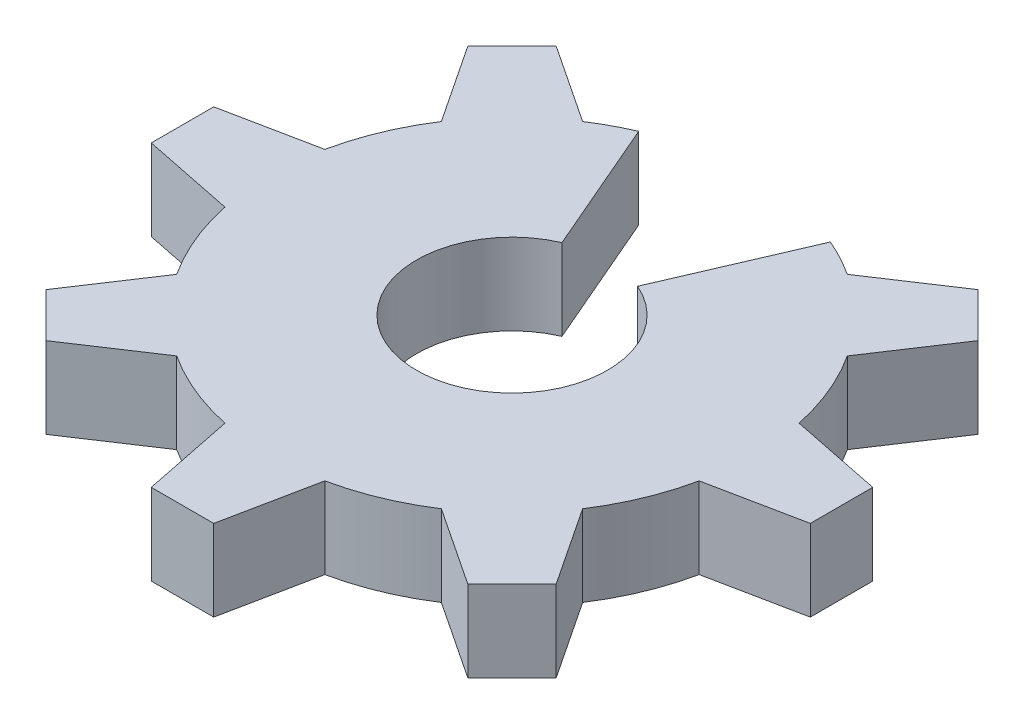
ISO-10303-21;
HEADER;
FILE_DESCRIPTION(('STEP AP214'),'2;1');
FILE_NAME('part.step','',(''),(''),'','','');
FILE_SCHEMA(('AUTOMOTIVE_DESIGN { 1 0 10303 214 1 1 1 1 }'));
ENDSEC;
DATA;
#1=APPLICATION_CONTEXT('core data for automotive mechanical design processes');
#2=APPLICATION_PROTOCOL_DEFINITION('international standard','automotive_design',2000,#1);
#3=PRODUCT_CONTEXT('',#1,'mechanical');
#4=PRODUCT('Part','Part','',(#3));
#5=PRODUCT_RELATED_PRODUCT_CATEGORY('part','',(#4));
#6=PRODUCT_DEFINITION_FORMATION('','',#4);
#7=PRODUCT_DEFINITION_CONTEXT('part definition',#1,'design');
#8=PRODUCT_DEFINITION('design','',#6,#7);
#9=PRODUCT_DEFINITION_SHAPE('','',#8);
#10=(LENGTH_UNIT() NAMED_UNIT(*) SI_UNIT(.MILLI.,.METRE.));
#11=(NAMED_UNIT(*) PLANE_ANGLE_UNIT() SI_UNIT($,.RADIAN.));
#12=(NAMED_UNIT(*) SI_UNIT($,.STERADIAN.) SOLID_ANGLE_UNIT());
#13=UNCERTAINTY_MEASURE_WITH_UNIT(LENGTH_MEASURE(1.E-05),#10,'distance_accuracy_value','');
#14=(GEOMETRIC_REPRESENTATION_CONTEXT(3) GLOBAL_UNCERTAINTY_ASSIGNED_CONTEXT((#13)) GLOBAL_UNIT_ASSIGNED_CONTEXT((#10,
#11,#12)) REPRESENTATION_CONTEXT('',''));
#15=CARTESIAN_POINT('',(0.,0.,0.));
#16=DIRECTION('',(0.,0.,1.));
#17=DIRECTION('',(1.,0.,0.));
#18=AXIS2_PLACEMENT_3D('',#15,#16,#17);
#19=CARTESIAN_POINT('',(2.09488880330588E-13,1.3,15.64));
#20=DIRECTION('',(0.,-1.,0.));
#21=DIRECTION('',(0.,0.,-1.));
#22=AXIS2_PLACEMENT_3D('',#19,#20,#21);
#23=CYLINDRICAL_SURFACE('',#22,3.88);
#24=CARTESIAN_POINT('',(2.09488880330588E-13,0.,15.64));
#25=DIRECTION('',(0.,1.,0.));
#26=DIRECTION('',(0.,0.,1.));
#27=AXIS2_PLACEMENT_3D('',#24,#25,#26);
#28=CIRCLE('',#27,3.88);
#29=CARTESIAN_POINT('',(-1.53471654994409,0.,12.0764280403888));
#30=VERTEX_POINT('',#29);
#31=CARTESIAN_POINT('',(-2.11893745359421,0.,12.3896916965071));
#32=VERTEX_POINT('',#31);
#33=EDGE_CURVE('E272',#30,#32,#28,.T.);
#34=ORIENTED_EDGE('',*,*,#33,.T.);
#35=DIRECTION('',(0.,-1.,0.));
#36=VECTOR('',#35,1.);
#37=CARTESIAN_POINT('',(-2.11893745359421,1.3,12.3896916965071));
#38=LINE('',#37,#36);
#39=CARTESIAN_POINT('',(-2.11893745359421,1.3,12.3896916965071));
#40=VERTEX_POINT('',#39);
#41=EDGE_CURVE('E11',#40,#32,#38,.T.);
#42=ORIENTED_EDGE('',*,*,#41,.F.);
#43=CARTESIAN_POINT('',(2.09488880330588E-13,1.3,15.64));
#44=DIRECTION('',(0.,1.,0.));
#45=DIRECTION('',(0.,0.,1.));
#46=AXIS2_PLACEMENT_3D('',#43,#44,#45);
#47=CIRCLE('',#46,3.88);
#48=CARTESIAN_POINT('',(-1.53471654994409,1.3,12.0764280403888));
#49=VERTEX_POINT('',#48);
#50=EDGE_CURVE('E341',#49,#40,#47,.T.);
#51=ORIENTED_EDGE('',*,*,#50,.F.);
#52=DIRECTION('',(0.,-1.,0.));
#53=VECTOR('',#52,1.);
#54=CARTESIAN_POINT('',(-1.53471654994409,1.3,12.0764280403888));
#55=LINE('',#54,#53);
#56=EDGE_CURVE('E268',#49,#30,#55,.T.);
#57=ORIENTED_EDGE('',*,*,#56,.T.);
#58=EDGE_LOOP('',(#34,#42,#51,#57));
#59=FACE_BOUND('',#58,.T.);
#60=ADVANCED_FACE('F32',(#59),#23,.T.);
#61=CARTESIAN_POINT('',(-3.37739823064205,1.3,11.5554949881712));
#62=DIRECTION('',(-0.552507803813663,0.,0.833507724454311));
#63=DIRECTION('',(0.833507724454311,0.,0.552507803813663));
#64=AXIS2_PLACEMENT_3D('',#61,#62,#63);
#65=PLANE('',#64);
#66=DIRECTION('',(-0.83350772445431,0.,-0.552507803813663));
#67=VECTOR('',#66,1.);
#68=CARTESIAN_POINT('',(-3.37739823064205,0.,11.5554949881712));
#69=LINE('',#68,#67);
#70=CARTESIAN_POINT('',(-3.37739823064205,0.,11.5554949881712));
#71=VERTEX_POINT('',#70);
#72=EDGE_CURVE('E275',#32,#71,#69,.T.);
#73=ORIENTED_EDGE('',*,*,#72,.T.);
#74=DIRECTION('',(0.,-1.,0.));
#75=VECTOR('',#74,1.);
#76=CARTESIAN_POINT('',(-3.37739823064205,1.3,11.5554949881712));
#77=LINE('',#76,#75);
#78=CARTESIAN_POINT('',(-3.37739823064205,1.3,11.5554949881712));
#79=VERTEX_POINT('',#78);
#80=EDGE_CURVE('E40',#79,#71,#77,.T.);
#81=ORIENTED_EDGE('',*,*,#80,.F.);
#82=DIRECTION('',(-0.83350772445431,0.,-0.552507803813663));
#83=VECTOR('',#82,1.);
#84=CARTESIAN_POINT('',(-3.37739823064205,1.3,11.5554949881712));
#85=LINE('',#84,#83);
#86=EDGE_CURVE('E163',#40,#79,#85,.T.);
#87=ORIENTED_EDGE('',*,*,#86,.F.);
#88=ORIENTED_EDGE('',*,*,#41,.T.);
#89=EDGE_LOOP('',(#73,#81,#87,#88));
#90=FACE_BOUND('',#89,.T.);
#91=ADVANCED_FACE('F428',(#90),#65,.F.);
#92=CARTESIAN_POINT('',(-4.0845050118286,1.3,12.2626017693578));
#93=DIRECTION('',(0.707106781186547,0.,0.707106781186548));
#94=DIRECTION('',(0.707106781186548,0.,-0.707106781186547));
#95=AXIS2_PLACEMENT_3D('',#92,#93,#94);
#96=PLANE('',#95);
#97=DIRECTION('',(-0.707106781186548,0.,0.707106781186547));
#98=VECTOR('',#97,1.);
#99=CARTESIAN_POINT('',(-4.0845050118286,0.,12.2626017693578));
#100=LINE('',#99,#98);
#101=CARTESIAN_POINT('',(-4.0845050118286,0.,12.2626017693578));
#102=VERTEX_POINT('',#101);
#103=EDGE_CURVE('E278',#71,#102,#100,.T.);
#104=ORIENTED_EDGE('',*,*,#103,.T.);
#105=DIRECTION('',(0.,-1.,0.));
#106=VECTOR('',#105,1.);
#107=CARTESIAN_POINT('',(-4.0845050118286,1.3,12.2626017693578));
#108=LINE('',#107,#106);
#109=CARTESIAN_POINT('',(-4.0845050118286,1.3,12.2626017693578));
#110=VERTEX_POINT('',#109);
#111=EDGE_CURVE('E420',#110,#102,#108,.T.);
#112=ORIENTED_EDGE('',*,*,#111,.F.);
#113=DIRECTION('',(-0.707106781186542,0.,0.707106781186554));
#114=VECTOR('',#113,1.);
#115=CARTESIAN_POINT('',(-3.73095162123532,1.3,11.9090483787645));
#116=LINE('',#115,#114);
#117=EDGE_CURVE('E427',#79,#110,#116,.T.);
#118=ORIENTED_EDGE('',*,*,#117,.F.);
#119=ORIENTED_EDGE('',*,*,#80,.T.);
#120=EDGE_LOOP('',(#104,#112,#118,#119));
#121=FACE_BOUND('',#120,.T.);
#122=ADVANCED_FACE('F425',(#121),#96,.F.);
#123=CARTESIAN_POINT('',(-4.0845050118286,1.3,12.2626017693578));
#124=DIRECTION('',(0.833507724454307,0.,-0.552507803813668));
#125=DIRECTION('',(-0.552507803813668,0.,-0.833507724454307));
#126=AXIS2_PLACEMENT_3D('',#123,#124,#125);
#127=PLANE('',#126);
#128=DIRECTION('',(0.552507803813668,0.,0.833507724454307));
#129=VECTOR('',#128,1.);
#130=CARTESIAN_POINT('',(-4.0845050118286,0.,12.2626017693578));
#131=LINE('',#130,#129);
#132=CARTESIAN_POINT('',(-3.25030830349268,0.,13.5210625464056));
#133=VERTEX_POINT('',#132);
#134=EDGE_CURVE('E280',#102,#133,#131,.T.);
#135=ORIENTED_EDGE('',*,*,#134,.T.);
#136=DIRECTION('',(0.,-1.,0.));
#137=VECTOR('',#136,1.);
#138=CARTESIAN_POINT('',(-3.25030830349268,1.3,13.5210625464056));
#139=LINE('',#138,#137);
#140=CARTESIAN_POINT('',(-3.25030830349268,1.3,13.5210625464056));
#141=VERTEX_POINT('',#140);
#142=EDGE_CURVE('E417',#141,#133,#139,.T.);
#143=ORIENTED_EDGE('',*,*,#142,.F.);
#144=DIRECTION('',(0.552507803813668,0.,0.833507724454307));
#145=VECTOR('',#144,1.);
#146=CARTESIAN_POINT('',(-4.0845050118286,1.3,12.2626017693578));
#147=LINE('',#146,#145);
#148=EDGE_CURVE('E447',#110,#141,#147,.T.);
#149=ORIENTED_EDGE('',*,*,#148,.F.);
#150=ORIENTED_EDGE('',*,*,#111,.T.);
#151=EDGE_LOOP('',(#135,#143,#149,#150));
#152=FACE_BOUND('',#151,.T.);
#153=ADVANCED_FACE('F438',(#152),#127,.F.);
#154=CARTESIAN_POINT('',(2.09488880330588E-13,1.3,15.64));
#155=DIRECTION('',(0.,-1.,0.));
#156=DIRECTION('',(0.,0.,-1.));
#157=AXIS2_PLACEMENT_3D('',#154,#155,#156);
#158=CYLINDRICAL_SURFACE('',#157,3.88);
#159=CARTESIAN_POINT('',(2.09488880330588E-13,0.,15.64));
#160=DIRECTION('',(0.,1.,0.));
#161=DIRECTION('',(0.,0.,1.));
#162=AXIS2_PLACEMENT_3D('',#159,#160,#161);
#163=CIRCLE('',#162,3.88);
#164=CARTESIAN_POINT('',(-3.79663008469332,0.,14.84));
#165=VERTEX_POINT('',#164);
#166=EDGE_CURVE('E282',#133,#165,#163,.T.);
#167=ORIENTED_EDGE('',*,*,#166,.T.);
#168=DIRECTION('',(0.,-1.,0.));
#169=VECTOR('',#168,1.);
#170=CARTESIAN_POINT('',(-3.79663008469332,1.3,14.84));
#171=LINE('',#170,#169);
#172=CARTESIAN_POINT('',(-3.79663008469332,1.3,14.84));
#173=VERTEX_POINT('',#172);
#174=EDGE_CURVE('E414',#173,#165,#171,.T.);
#175=ORIENTED_EDGE('',*,*,#174,.F.);
#176=CARTESIAN_POINT('',(2.09488880330588E-13,1.3,15.64));
#177=DIRECTION('',(0.,1.,0.));
#178=DIRECTION('',(0.,0.,1.));
#179=AXIS2_PLACEMENT_3D('',#176,#177,#178);
#180=CIRCLE('',#179,3.88);
#181=EDGE_CURVE('E444',#141,#173,#180,.T.);
#182=ORIENTED_EDGE('',*,*,#181,.F.);
#183=ORIENTED_EDGE('',*,*,#142,.T.);
#184=EDGE_LOOP('',(#167,#175,#182,#183));
#185=FACE_BOUND('',#184,.T.);
#186=ADVANCED_FACE('F442',(#185),#158,.T.);
#187=CARTESIAN_POINT('',(-5.27636238330896,1.3,15.14));
#188=DIRECTION('',(0.198696949397887,0.,0.980060978868138));
#189=DIRECTION('',(0.980060978868139,0.,-0.198696949397887));
#190=AXIS2_PLACEMENT_3D('',#187,#188,#189);
#191=PLANE('',#190);
#192=DIRECTION('',(-0.980060978868138,0.,0.198696949397887));
#193=VECTOR('',#192,1.);
#194=CARTESIAN_POINT('',(-5.27636238330896,0.,15.14));
#195=LINE('',#194,#193);
#196=CARTESIAN_POINT('',(-5.27636238330896,0.,15.14));
#197=VERTEX_POINT('',#196);
#198=EDGE_CURVE('E284',#165,#197,#195,.T.);
#199=ORIENTED_EDGE('',*,*,#198,.T.);
#200=DIRECTION('',(0.,-1.,0.));
#201=VECTOR('',#200,1.);
#202=CARTESIAN_POINT('',(-5.27636238330896,1.3,15.14));
#203=LINE('',#202,#201);
#204=CARTESIAN_POINT('',(-5.27636238330896,1.3,15.14));
#205=VERTEX_POINT('',#204);
#206=EDGE_CURVE('E411',#205,#197,#203,.T.);
#207=ORIENTED_EDGE('',*,*,#206,.F.);
#208=DIRECTION('',(-0.980060978868138,0.,0.198696949397887));
#209=VECTOR('',#208,1.);
#210=CARTESIAN_POINT('',(-5.27636238330896,1.3,15.14));
#211=LINE('',#210,#209);
#212=EDGE_CURVE('E446',#173,#205,#211,.T.);
#213=ORIENTED_EDGE('',*,*,#212,.F.);
#214=ORIENTED_EDGE('',*,*,#174,.T.);
#215=EDGE_LOOP('',(#199,#207,#213,#214));
#216=FACE_BOUND('',#215,.T.);
#217=ADVANCED_FACE('F787',(#216),#191,.F.);
#218=CARTESIAN_POINT('',(-5.27636238330896,1.3,16.14));
#219=DIRECTION('',(1.,0.,0.));
#220=DIRECTION('',(0.,0.,-1.));
#221=AXIS2_PLACEMENT_3D('',#218,#219,#220);
#222=PLANE('',#221);
#223=DIRECTION('',(0.,0.,1.));
#224=VECTOR('',#223,1.);
#225=CARTESIAN_POINT('',(-5.27636238330896,0.,16.14));
#226=LINE('',#225,#224);
#227=CARTESIAN_POINT('',(-5.27636238330896,0.,16.14));
#228=VERTEX_POINT('',#227);
#229=EDGE_CURVE('E287',#197,#228,#226,.T.);
#230=ORIENTED_EDGE('',*,*,#229,.T.);
#231=DIRECTION('',(0.,-1.,0.));
#232=VECTOR('',#231,1.);
#233=CARTESIAN_POINT('',(-5.27636238330896,1.3,16.14));
#234=LINE('',#233,#232);
#235=CARTESIAN_POINT('',(-5.27636238330896,1.3,16.14));
#236=VERTEX_POINT('',#235);
#237=EDGE_CURVE('E408',#236,#228,#234,.T.);
#238=ORIENTED_EDGE('',*,*,#237,.F.);
#239=DIRECTION('',(0.,0.,1.));
#240=VECTOR('',#239,1.);
#241=CARTESIAN_POINT('',(-5.27636238330896,1.3,15.64));
#242=LINE('',#241,#240);
#243=EDGE_CURVE('E449',#205,#236,#242,.T.);
#244=ORIENTED_EDGE('',*,*,#243,.F.);
#245=ORIENTED_EDGE('',*,*,#206,.T.);
#246=EDGE_LOOP('',(#230,#238,#244,#245));
#247=FACE_BOUND('',#246,.T.);
#248=ADVANCED_FACE('F777',(#247),#222,.F.);
#249=CARTESIAN_POINT('',(-5.27636238330896,1.3,16.14));
#250=DIRECTION('',(0.198696949397878,0.,-0.98006097886814));
#251=DIRECTION('',(-0.98006097886814,0.,-0.198696949397878));
#252=AXIS2_PLACEMENT_3D('',#249,#250,#251);
#253=PLANE('',#252);
#254=DIRECTION('',(0.98006097886814,0.,0.198696949397878));
#255=VECTOR('',#254,1.);
#256=CARTESIAN_POINT('',(-5.27636238330896,0.,16.14));
#257=LINE('',#256,#255);
#258=CARTESIAN_POINT('',(-3.79663008469332,0.,16.44));
#259=VERTEX_POINT('',#258);
#260=EDGE_CURVE('E289',#228,#259,#257,.T.);
#261=ORIENTED_EDGE('',*,*,#260,.T.);
#262=DIRECTION('',(0.,-1.,0.));
#263=VECTOR('',#262,1.);
#264=CARTESIAN_POINT('',(-3.79663008469332,1.3,16.44));
#265=LINE('',#264,#263);
#266=CARTESIAN_POINT('',(-3.79663008469332,1.3,16.44));
#267=VERTEX_POINT('',#266);
#268=EDGE_CURVE('E405',#267,#259,#265,.T.);
#269=ORIENTED_EDGE('',*,*,#268,.F.);
#270=DIRECTION('',(0.98006097886814,0.,0.198696949397878));
#271=VECTOR('',#270,1.);
#272=CARTESIAN_POINT('',(-5.27636238330896,1.3,16.14));
#273=LINE('',#272,#271);
#274=EDGE_CURVE('E455',#236,#267,#273,.T.);
#275=ORIENTED_EDGE('',*,*,#274,.F.);
#276=ORIENTED_EDGE('',*,*,#237,.T.);
#277=EDGE_LOOP('',(#261,#269,#275,#276));
#278=FACE_BOUND('',#277,.T.);
#279=ADVANCED_FACE('F767',(#278),#253,.F.);
#280=CARTESIAN_POINT('',(2.09488880330588E-13,1.3,15.64));
#281=DIRECTION('',(0.,-1.,0.));
#282=DIRECTION('',(0.,0.,-1.));
#283=AXIS2_PLACEMENT_3D('',#280,#281,#282);
#284=CYLINDRICAL_SURFACE('',#283,3.88);
#285=CARTESIAN_POINT('',(2.09488880330588E-13,0.,15.64));
#286=DIRECTION('',(0.,1.,0.));
#287=DIRECTION('',(0.,0.,1.));
#288=AXIS2_PLACEMENT_3D('',#285,#286,#287);
#289=CIRCLE('',#288,3.88);
#290=CARTESIAN_POINT('',(-3.25030830349266,0.,17.7589374535944));
#291=VERTEX_POINT('',#290);
#292=EDGE_CURVE('E291',#259,#291,#289,.T.);
#293=ORIENTED_EDGE('',*,*,#292,.T.);
#294=DIRECTION('',(0.,-1.,0.));
#295=VECTOR('',#294,1.);
#296=CARTESIAN_POINT('',(-3.25030830349266,1.3,17.7589374535944));
#297=LINE('',#296,#295);
#298=CARTESIAN_POINT('',(-3.25030830349266,1.3,17.7589374535944));
#299=VERTEX_POINT('',#298);
#300=EDGE_CURVE('E402',#299,#291,#297,.T.);
#301=ORIENTED_EDGE('',*,*,#300,.F.);
#302=CARTESIAN_POINT('',(2.09488880330588E-13,1.3,15.64));
#303=DIRECTION('',(0.,1.,0.));
#304=DIRECTION('',(0.,0.,1.));
#305=AXIS2_PLACEMENT_3D('',#302,#303,#304);
#306=CIRCLE('',#305,3.88);
#307=EDGE_CURVE('E457',#267,#299,#306,.T.);
#308=ORIENTED_EDGE('',*,*,#307,.F.);
#309=ORIENTED_EDGE('',*,*,#268,.T.);
#310=EDGE_LOOP('',(#293,#301,#308,#309));
#311=FACE_BOUND('',#310,.T.);
#312=ADVANCED_FACE('F757',(#311),#284,.T.);
#313=CARTESIAN_POINT('',(-4.08450501182857,1.3,19.0173982306423));
#314=DIRECTION('',(0.833507724454309,0.,0.552507803813666));
#315=DIRECTION('',(0.552507803813666,0.,-0.833507724454309));
#316=AXIS2_PLACEMENT_3D('',#313,#314,#315);
#317=PLANE('',#316);
#318=DIRECTION('',(-0.552507803813666,0.,0.833507724454309));
#319=VECTOR('',#318,1.);
#320=CARTESIAN_POINT('',(-4.08450501182857,0.,19.0173982306423));
#321=LINE('',#320,#319);
#322=CARTESIAN_POINT('',(-4.08450501182857,0.,19.0173982306423));
#323=VERTEX_POINT('',#322);
#324=EDGE_CURVE('E293',#291,#323,#321,.T.);
#325=ORIENTED_EDGE('',*,*,#324,.T.);
#326=DIRECTION('',(0.,-1.,0.));
#327=VECTOR('',#326,1.);
#328=CARTESIAN_POINT('',(-4.08450501182857,1.3,19.0173982306423));
#329=LINE('',#328,#327);
#330=CARTESIAN_POINT('',(-4.08450501182857,1.3,19.0173982306423));
#331=VERTEX_POINT('',#330);
#332=EDGE_CURVE('E399',#331,#323,#329,.T.);
#333=ORIENTED_EDGE('',*,*,#332,.F.);
#334=DIRECTION('',(-0.552507803813666,0.,0.833507724454309));
#335=VECTOR('',#334,1.);
#336=CARTESIAN_POINT('',(-4.08450501182857,1.3,19.0173982306423));
#337=LINE('',#336,#335);
#338=EDGE_CURVE('E459',#299,#331,#337,.T.);
#339=ORIENTED_EDGE('',*,*,#338,.F.);
#340=ORIENTED_EDGE('',*,*,#300,.T.);
#341=EDGE_LOOP('',(#325,#333,#339,#340));
#342=FACE_BOUND('',#341,.T.);
#343=ADVANCED_FACE('F746',(#342),#317,.F.);
#344=CARTESIAN_POINT('',(-3.37739823064202,1.3,19.7245050118288));
#345=DIRECTION('',(0.707106781186542,0.,-0.707106781186553));
#346=DIRECTION('',(-0.707106781186553,0.,-0.707106781186542));
#347=AXIS2_PLACEMENT_3D('',#344,#345,#346);
#348=PLANE('',#347);
#349=DIRECTION('',(0.707106781186553,0.,0.707106781186542));
#350=VECTOR('',#349,1.);
#351=CARTESIAN_POINT('',(-3.37739823064202,0.,19.7245050118288));
#352=LINE('',#351,#350);
#353=CARTESIAN_POINT('',(-3.37739823064202,0.,19.7245050118288));
#354=VERTEX_POINT('',#353);
#355=EDGE_CURVE('E296',#323,#354,#352,.T.);
#356=ORIENTED_EDGE('',*,*,#355,.T.);
#357=DIRECTION('',(0.,-1.,0.));
#358=VECTOR('',#357,1.);
#359=CARTESIAN_POINT('',(-3.37739823064202,1.3,19.7245050118288));
#360=LINE('',#359,#358);
#361=CARTESIAN_POINT('',(-3.37739823064202,1.3,19.7245050118288));
#362=VERTEX_POINT('',#361);
#363=EDGE_CURVE('E396',#362,#354,#360,.T.);
#364=ORIENTED_EDGE('',*,*,#363,.F.);
#365=DIRECTION('',(0.707106781186558,0.,0.707106781186537));
#366=VECTOR('',#365,1.);
#367=CARTESIAN_POINT('',(-3.73095162123529,1.3,19.3709516212355));
#368=LINE('',#367,#366);
#369=EDGE_CURVE('E461',#331,#362,#368,.T.);
#370=ORIENTED_EDGE('',*,*,#369,.F.);
#371=ORIENTED_EDGE('',*,*,#332,.T.);
#372=EDGE_LOOP('',(#356,#364,#370,#371));
#373=FACE_BOUND('',#372,.T.);
#374=ADVANCED_FACE('F736',(#373),#348,.F.);
#375=CARTESIAN_POINT('',(-2.11893745359418,1.3,18.8903083034929));
#376=DIRECTION('',(-0.552507803813666,0.,-0.833507724454309));
#377=DIRECTION('',(-0.833507724454309,0.,0.552507803813666));
#378=AXIS2_PLACEMENT_3D('',#375,#376,#377);
#379=PLANE('',#378);
#380=DIRECTION('',(0.833507724454309,0.,-0.552507803813666));
#381=VECTOR('',#380,1.);
#382=CARTESIAN_POINT('',(-2.11893745359418,0.,18.8903083034929));
#383=LINE('',#382,#381);
#384=CARTESIAN_POINT('',(-2.11893745359418,0.,18.8903083034929));
#385=VERTEX_POINT('',#384);
#386=EDGE_CURVE('E298',#354,#385,#383,.T.);
#387=ORIENTED_EDGE('',*,*,#386,.T.);
#388=DIRECTION('',(0.,-1.,0.));
#389=VECTOR('',#388,1.);
#390=CARTESIAN_POINT('',(-2.11893745359418,1.3,18.8903083034929));
#391=LINE('',#390,#389);
#392=CARTESIAN_POINT('',(-2.11893745359418,1.3,18.8903083034929));
#393=VERTEX_POINT('',#392);
#394=EDGE_CURVE('E393',#393,#385,#391,.T.);
#395=ORIENTED_EDGE('',*,*,#394,.F.);
#396=DIRECTION('',(0.833507724454309,0.,-0.552507803813666));
#397=VECTOR('',#396,1.);
#398=CARTESIAN_POINT('',(-2.11893745359418,1.3,18.8903083034929));
#399=LINE('',#398,#397);
#400=EDGE_CURVE('E463',#362,#393,#399,.T.);
#401=ORIENTED_EDGE('',*,*,#400,.F.);
#402=ORIENTED_EDGE('',*,*,#363,.T.);
#403=EDGE_LOOP('',(#387,#395,#401,#402));
#404=FACE_BOUND('',#403,.T.);
#405=ADVANCED_FACE('F726',(#404),#379,.F.);
#406=CARTESIAN_POINT('',(2.09488880330588E-13,1.3,15.64));
#407=DIRECTION('',(0.,-1.,0.));
#408=DIRECTION('',(0.,0.,-1.));
#409=AXIS2_PLACEMENT_3D('',#406,#407,#408);
#410=CYLINDRICAL_SURFACE('',#409,3.88);
#411=CARTESIAN_POINT('',(2.09488880330588E-13,0.,15.64));
#412=DIRECTION('',(0.,1.,0.));
#413=DIRECTION('',(0.,0.,1.));
#414=AXIS2_PLACEMENT_3D('',#411,#412,#413);
#415=CIRCLE('',#414,3.88);
#416=CARTESIAN_POINT('',(-0.799999999999793,0.,19.4366300846935));
#417=VERTEX_POINT('',#416);
#418=EDGE_CURVE('E300',#385,#417,#415,.T.);
#419=ORIENTED_EDGE('',*,*,#418,.T.);
#420=DIRECTION('',(0.,-1.,0.));
#421=VECTOR('',#420,1.);
#422=CARTESIAN_POINT('',(-0.799999999999793,1.3,19.4366300846935));
#423=LINE('',#422,#421);
#424=CARTESIAN_POINT('',(-0.799999999999793,1.3,19.4366300846935));
#425=VERTEX_POINT('',#424);
#426=EDGE_CURVE('E390',#425,#417,#423,.T.);
#427=ORIENTED_EDGE('',*,*,#426,.F.);
#428=CARTESIAN_POINT('',(2.09488880330588E-13,1.3,15.64));
#429=DIRECTION('',(0.,1.,0.));
#430=DIRECTION('',(0.,0.,1.));
#431=AXIS2_PLACEMENT_3D('',#428,#429,#430);
#432=CIRCLE('',#431,3.88);
#433=EDGE_CURVE('E465',#393,#425,#432,.T.);
#434=ORIENTED_EDGE('',*,*,#433,.F.);
#435=ORIENTED_EDGE('',*,*,#394,.T.);
#436=EDGE_LOOP('',(#419,#427,#434,#435));
#437=FACE_BOUND('',#436,.T.);
#438=ADVANCED_FACE('F716',(#437),#410,.T.);
#439=CARTESIAN_POINT('',(-0.499999999999792,1.3,20.9163623833092));
#440=DIRECTION('',(0.98006097886814,0.,-0.198696949397881));
#441=DIRECTION('',(-0.198696949397881,0.,-0.98006097886814));
#442=AXIS2_PLACEMENT_3D('',#439,#440,#441);
#443=PLANE('',#442);
#444=DIRECTION('',(0.198696949397881,0.,0.98006097886814));
#445=VECTOR('',#444,1.);
#446=CARTESIAN_POINT('',(-0.499999999999792,0.,20.9163623833092));
#447=LINE('',#446,#445);
#448=CARTESIAN_POINT('',(-0.499999999999792,0.,20.9163623833092));
#449=VERTEX_POINT('',#448);
#450=EDGE_CURVE('E302',#417,#449,#447,.T.);
#451=ORIENTED_EDGE('',*,*,#450,.T.);
#452=DIRECTION('',(0.,-1.,0.));
#453=VECTOR('',#452,1.);
#454=CARTESIAN_POINT('',(-0.499999999999792,1.3,20.9163623833092));
#455=LINE('',#454,#453);
#456=CARTESIAN_POINT('',(-0.499999999999792,1.3,20.9163623833092));
#457=VERTEX_POINT('',#456);
#458=EDGE_CURVE('E387',#457,#449,#455,.T.);
#459=ORIENTED_EDGE('',*,*,#458,.F.);
#460=DIRECTION('',(0.198696949397881,0.,0.98006097886814));
#461=VECTOR('',#460,1.);
#462=CARTESIAN_POINT('',(-0.499999999999792,1.3,20.9163623833092));
#463=LINE('',#462,#461);
#464=EDGE_CURVE('E467',#425,#457,#463,.T.);
#465=ORIENTED_EDGE('',*,*,#464,.F.);
#466=ORIENTED_EDGE('',*,*,#426,.T.);
#467=EDGE_LOOP('',(#451,#459,#465,#466));
#468=FACE_BOUND('',#467,.T.);
#469=ADVANCED_FACE('F705',(#468),#443,.F.);
#470=CARTESIAN_POINT('',(2.07537316420114E-13,1.3,20.9163623833092));
#471=DIRECTION('',(0.,0.,-1.));
#472=DIRECTION('',(-1.,0.,0.));
#473=AXIS2_PLACEMENT_3D('',#470,#471,#472);
#474=PLANE('',#473);
#475=DIRECTION('',(1.,0.,0.));
#476=VECTOR('',#475,1.);
#477=CARTESIAN_POINT('',(2.07537316420114E-13,0.,20.9163623833092));
#478=LINE('',#477,#476);
#479=CARTESIAN_POINT('',(0.500000000000207,0.,20.9163623833092));
#480=VERTEX_POINT('',#479);
#481=EDGE_CURVE('E305',#449,#480,#478,.T.);
#482=ORIENTED_EDGE('',*,*,#481,.T.);
#483=DIRECTION('',(0.,-1.,0.));
#484=VECTOR('',#483,1.);
#485=CARTESIAN_POINT('',(0.500000000000207,1.3,20.9163623833092));
#486=LINE('',#485,#484);
#487=CARTESIAN_POINT('',(0.500000000000207,1.3,20.9163623833092));
#488=VERTEX_POINT('',#487);
#489=EDGE_CURVE('E384',#488,#480,#486,.T.);
#490=ORIENTED_EDGE('',*,*,#489,.F.);
#491=DIRECTION('',(1.,0.,0.));
#492=VECTOR('',#491,1.);
#493=CARTESIAN_POINT('',(2.07537316420114E-13,1.3,20.9163623833092));
#494=LINE('',#493,#492);
#495=EDGE_CURVE('E469',#457,#488,#494,.T.);
#496=ORIENTED_EDGE('',*,*,#495,.F.);
#497=ORIENTED_EDGE('',*,*,#458,.T.);
#498=EDGE_LOOP('',(#482,#490,#496,#497));
#499=FACE_BOUND('',#498,.T.);
#500=ADVANCED_FACE('F695',(#499),#474,.F.);
#501=CARTESIAN_POINT('',(0.500000000000207,1.3,20.9163623833092));
#502=DIRECTION('',(-0.98006097886814,0.,-0.19869694939788));
#503=DIRECTION('',(-0.19869694939788,0.,0.98006097886814));
#504=AXIS2_PLACEMENT_3D('',#501,#502,#503);
#505=PLANE('',#504);
#506=DIRECTION('',(0.19869694939788,0.,-0.98006097886814));
#507=VECTOR('',#506,1.);
#508=CARTESIAN_POINT('',(0.500000000000207,0.,20.9163623833092));
#509=LINE('',#508,#507);
#510=CARTESIAN_POINT('',(0.800000000000204,0.,19.4366300846935));
#511=VERTEX_POINT('',#510);
#512=EDGE_CURVE('E307',#480,#511,#509,.T.);
#513=ORIENTED_EDGE('',*,*,#512,.T.);
#514=DIRECTION('',(0.,-1.,0.));
#515=VECTOR('',#514,1.);
#516=CARTESIAN_POINT('',(0.800000000000204,1.3,19.4366300846935));
#517=LINE('',#516,#515);
#518=CARTESIAN_POINT('',(0.800000000000204,1.3,19.4366300846935));
#519=VERTEX_POINT('',#518);
#520=EDGE_CURVE('E381',#519,#511,#517,.T.);
#521=ORIENTED_EDGE('',*,*,#520,.F.);
#522=DIRECTION('',(0.19869694939788,0.,-0.98006097886814));
#523=VECTOR('',#522,1.);
#524=CARTESIAN_POINT('',(0.500000000000207,1.3,20.9163623833092));
#525=LINE('',#524,#523);
#526=EDGE_CURVE('E471',#488,#519,#525,.T.);
#527=ORIENTED_EDGE('',*,*,#526,.F.);
#528=ORIENTED_EDGE('',*,*,#489,.T.);
#529=EDGE_LOOP('',(#513,#521,#527,#528));
#530=FACE_BOUND('',#529,.T.);
#531=ADVANCED_FACE('F685',(#530),#505,.F.);
#532=CARTESIAN_POINT('',(2.09488880330588E-13,1.3,15.64));
#533=DIRECTION('',(0.,-1.,0.));
#534=DIRECTION('',(0.,0.,-1.));
#535=AXIS2_PLACEMENT_3D('',#532,#533,#534);
#536=CYLINDRICAL_SURFACE('',#535,3.88);
#537=CARTESIAN_POINT('',(2.09488880330588E-13,0.,15.64));
#538=DIRECTION('',(0.,1.,0.));
#539=DIRECTION('',(0.,0.,1.));
#540=AXIS2_PLACEMENT_3D('',#537,#538,#539);
#541=CIRCLE('',#540,3.88);
#542=CARTESIAN_POINT('',(2.1189374535946,0.,18.8903083034929));
#543=VERTEX_POINT('',#542);
#544=EDGE_CURVE('E309',#511,#543,#541,.T.);
#545=ORIENTED_EDGE('',*,*,#544,.T.);
#546=DIRECTION('',(0.,-1.,0.));
#547=VECTOR('',#546,1.);
#548=CARTESIAN_POINT('',(2.1189374535946,1.3,18.8903083034929));
#549=LINE('',#548,#547);
#550=CARTESIAN_POINT('',(2.1189374535946,1.3,18.8903083034929));
#551=VERTEX_POINT('',#550);
#552=EDGE_CURVE('E378',#551,#543,#549,.T.);
#553=ORIENTED_EDGE('',*,*,#552,.F.);
#554=CARTESIAN_POINT('',(2.09488880330588E-13,1.3,15.64));
#555=DIRECTION('',(0.,1.,0.));
#556=DIRECTION('',(0.,0.,1.));
#557=AXIS2_PLACEMENT_3D('',#554,#555,#556);
#558=CIRCLE('',#557,3.88);
#559=EDGE_CURVE('E473',#519,#551,#558,.T.);
#560=ORIENTED_EDGE('',*,*,#559,.F.);
#561=ORIENTED_EDGE('',*,*,#520,.T.);
#562=EDGE_LOOP('',(#545,#553,#560,#561));
#563=FACE_BOUND('',#562,.T.);
#564=ADVANCED_FACE('F675',(#563),#536,.T.);
#565=CARTESIAN_POINT('',(2.1189374535946,1.3,18.8903083034929));
#566=DIRECTION('',(0.552507803813673,0.,-0.833507724454304));
#567=DIRECTION('',(-0.833507724454304,0.,-0.552507803813673));
#568=AXIS2_PLACEMENT_3D('',#565,#566,#567);
#569=PLANE('',#568);
#570=DIRECTION('',(0.833507724454304,0.,0.552507803813673));
#571=VECTOR('',#570,1.);
#572=CARTESIAN_POINT('',(2.1189374535946,0.,18.8903083034929));
#573=LINE('',#572,#571);
#574=CARTESIAN_POINT('',(3.37739823064244,0.,19.7245050118288));
#575=VERTEX_POINT('',#574);
#576=EDGE_CURVE('E311',#543,#575,#573,.T.);
#577=ORIENTED_EDGE('',*,*,#576,.T.);
#578=DIRECTION('',(0.,-1.,0.));
#579=VECTOR('',#578,1.);
#580=CARTESIAN_POINT('',(3.37739823064244,1.3,19.7245050118288));
#581=LINE('',#580,#579);
#582=CARTESIAN_POINT('',(3.37739823064244,1.3,19.7245050118288));
#583=VERTEX_POINT('',#582);
#584=EDGE_CURVE('E375',#583,#575,#581,.T.);
#585=ORIENTED_EDGE('',*,*,#584,.F.);
#586=DIRECTION('',(0.833507724454304,0.,0.552507803813673));
#587=VECTOR('',#586,1.);
#588=CARTESIAN_POINT('',(2.1189374535946,1.3,18.8903083034929));
#589=LINE('',#588,#587);
#590=EDGE_CURVE('E475',#551,#583,#589,.T.);
#591=ORIENTED_EDGE('',*,*,#590,.F.);
#592=ORIENTED_EDGE('',*,*,#552,.T.);
#593=EDGE_LOOP('',(#577,#585,#591,#592));
#594=FACE_BOUND('',#593,.T.);
#595=ADVANCED_FACE('F664',(#594),#569,.F.);
#596=CARTESIAN_POINT('',(3.73095162123571,1.3,19.3709516212355));
#597=DIRECTION('',(-0.707106781186544,0.,-0.707106781186551));
#598=DIRECTION('',(-0.707106781186551,0.,0.707106781186544));
#599=AXIS2_PLACEMENT_3D('',#596,#597,#598);
#600=PLANE('',#599);
#601=DIRECTION('',(0.707106781186551,0.,-0.707106781186544));
#602=VECTOR('',#601,1.);
#603=CARTESIAN_POINT('',(3.73095162123571,0.,19.3709516212355));
#604=LINE('',#603,#602);
#605=CARTESIAN_POINT('',(4.08450501182899,0.,19.0173982306423));
#606=VERTEX_POINT('',#605);
#607=EDGE_CURVE('E314',#575,#606,#604,.T.);
#608=ORIENTED_EDGE('',*,*,#607,.T.);
#609=DIRECTION('',(0.,-1.,0.));
#610=VECTOR('',#609,1.);
#611=CARTESIAN_POINT('',(4.08450501182899,1.3,19.0173982306423));
#612=LINE('',#611,#610);
#613=CARTESIAN_POINT('',(4.08450501182899,1.3,19.0173982306423));
#614=VERTEX_POINT('',#613);
#615=EDGE_CURVE('E372',#614,#606,#612,.T.);
#616=ORIENTED_EDGE('',*,*,#615,.F.);
#617=DIRECTION('',(0.707106781186549,0.,-0.707106781186546));
#618=VECTOR('',#617,1.);
#619=CARTESIAN_POINT('',(3.37739823064244,1.3,19.7245050118288));
#620=LINE('',#619,#618);
#621=EDGE_CURVE('E477',#583,#614,#620,.T.);
#622=ORIENTED_EDGE('',*,*,#621,.F.);
#623=ORIENTED_EDGE('',*,*,#584,.T.);
#624=EDGE_LOOP('',(#608,#616,#622,#623));
#625=FACE_BOUND('',#624,.T.);
#626=ADVANCED_FACE('F654',(#625),#600,.F.);
#627=CARTESIAN_POINT('',(4.08450501182899,1.3,19.0173982306423));
#628=DIRECTION('',(-0.833507724454317,0.,0.552507803813654));
#629=DIRECTION('',(0.552507803813654,0.,0.833507724454317));
#630=AXIS2_PLACEMENT_3D('',#627,#628,#629);
#631=PLANE('',#630);
#632=DIRECTION('',(-0.552507803813653,0.,-0.833507724454317));
#633=VECTOR('',#632,1.);
#634=CARTESIAN_POINT('',(4.08450501182899,0.,19.0173982306423));
#635=LINE('',#634,#633);
#636=CARTESIAN_POINT('',(3.25030830349309,0.,17.7589374535944));
#637=VERTEX_POINT('',#636);
#638=EDGE_CURVE('E316',#606,#637,#635,.T.);
#639=ORIENTED_EDGE('',*,*,#638,.T.);
#640=DIRECTION('',(0.,-1.,0.));
#641=VECTOR('',#640,1.);
#642=CARTESIAN_POINT('',(3.25030830349309,1.3,17.7589374535944));
#643=LINE('',#642,#641);
#644=CARTESIAN_POINT('',(3.25030830349309,1.3,17.7589374535944));
#645=VERTEX_POINT('',#644);
#646=EDGE_CURVE('E369',#645,#637,#643,.T.);
#647=ORIENTED_EDGE('',*,*,#646,.F.);
#648=DIRECTION('',(-0.552507803813653,0.,-0.833507724454317));
#649=VECTOR('',#648,1.);
#650=CARTESIAN_POINT('',(4.08450501182899,1.3,19.0173982306423));
#651=LINE('',#650,#649);
#652=EDGE_CURVE('E479',#614,#645,#651,.T.);
#653=ORIENTED_EDGE('',*,*,#652,.F.);
#654=ORIENTED_EDGE('',*,*,#615,.T.);
#655=EDGE_LOOP('',(#639,#647,#653,#654));
#656=FACE_BOUND('',#655,.T.);
#657=ADVANCED_FACE('F644',(#656),#631,.F.);
#658=CARTESIAN_POINT('',(2.09488880330588E-13,1.3,15.64));
#659=DIRECTION('',(0.,-1.,0.));
#660=DIRECTION('',(0.,0.,-1.));
#661=AXIS2_PLACEMENT_3D('',#658,#659,#660);
#662=CYLINDRICAL_SURFACE('',#661,3.88);
#663=CARTESIAN_POINT('',(2.09488880330588E-13,0.,15.64));
#664=DIRECTION('',(0.,1.,0.));
#665=DIRECTION('',(0.,0.,1.));
#666=AXIS2_PLACEMENT_3D('',#663,#664,#665);
#667=CIRCLE('',#666,3.88);
#668=CARTESIAN_POINT('',(3.79663008469374,0.,16.44));
#669=VERTEX_POINT('',#668);
#670=EDGE_CURVE('E318',#637,#669,#667,.T.);
#671=ORIENTED_EDGE('',*,*,#670,.T.);
#672=DIRECTION('',(0.,-1.,0.));
#673=VECTOR('',#672,1.);
#674=CARTESIAN_POINT('',(3.79663008469374,1.3,16.44));
#675=LINE('',#674,#673);
#676=CARTESIAN_POINT('',(3.79663008469374,1.3,16.44));
#677=VERTEX_POINT('',#676);
#678=EDGE_CURVE('E366',#677,#669,#675,.T.);
#679=ORIENTED_EDGE('',*,*,#678,.F.);
#680=CARTESIAN_POINT('',(2.09488880330588E-13,1.3,15.64));
#681=DIRECTION('',(0.,1.,0.));
#682=DIRECTION('',(0.,0.,1.));
#683=AXIS2_PLACEMENT_3D('',#680,#681,#682);
#684=CIRCLE('',#683,3.88);
#685=EDGE_CURVE('E481',#645,#677,#684,.T.);
#686=ORIENTED_EDGE('',*,*,#685,.F.);
#687=ORIENTED_EDGE('',*,*,#646,.T.);
#688=EDGE_LOOP('',(#671,#679,#686,#687));
#689=FACE_BOUND('',#688,.T.);
#690=ADVANCED_FACE('F634',(#689),#662,.T.);
#691=CARTESIAN_POINT('',(3.79663008469374,1.3,16.44));
#692=DIRECTION('',(-0.198696949397878,0.,-0.98006097886814));
#693=DIRECTION('',(-0.98006097886814,0.,0.198696949397878));
#694=AXIS2_PLACEMENT_3D('',#691,#692,#693);
#695=PLANE('',#694);
#696=DIRECTION('',(0.98006097886814,0.,-0.198696949397878));
#697=VECTOR('',#696,1.);
#698=CARTESIAN_POINT('',(3.79663008469374,0.,16.44));
#699=LINE('',#698,#697);
#700=CARTESIAN_POINT('',(5.27636238330938,0.,16.14));
#701=VERTEX_POINT('',#700);
#702=EDGE_CURVE('E320',#669,#701,#699,.T.);
#703=ORIENTED_EDGE('',*,*,#702,.T.);
#704=DIRECTION('',(0.,-1.,0.));
#705=VECTOR('',#704,1.);
#706=CARTESIAN_POINT('',(5.27636238330938,1.3,16.14));
#707=LINE('',#706,#705);
#708=CARTESIAN_POINT('',(5.27636238330938,1.3,16.14));
#709=VERTEX_POINT('',#708);
#710=EDGE_CURVE('E363',#709,#701,#707,.T.);
#711=ORIENTED_EDGE('',*,*,#710,.F.);
#712=DIRECTION('',(0.98006097886814,0.,-0.198696949397878));
#713=VECTOR('',#712,1.);
#714=CARTESIAN_POINT('',(3.79663008469374,1.3,16.44));
#715=LINE('',#714,#713);
#716=EDGE_CURVE('E483',#677,#709,#715,.T.);
#717=ORIENTED_EDGE('',*,*,#716,.F.);
#718=ORIENTED_EDGE('',*,*,#678,.T.);
#719=EDGE_LOOP('',(#703,#711,#717,#718));
#720=FACE_BOUND('',#719,.T.);
#721=ADVANCED_FACE('F623',(#720),#695,.F.);
#722=CARTESIAN_POINT('',(5.27636238330938,1.3,15.64));
#723=DIRECTION('',(-1.,0.,0.));
#724=DIRECTION('',(0.,0.,1.));
#725=AXIS2_PLACEMENT_3D('',#722,#723,#724);
#726=PLANE('',#725);
#727=DIRECTION('',(0.,0.,-1.));
#728=VECTOR('',#727,1.);
#729=CARTESIAN_POINT('',(5.27636238330938,0.,15.64));
#730=LINE('',#729,#728);
#731=CARTESIAN_POINT('',(5.27636238330938,0.,15.14));
#732=VERTEX_POINT('',#731);
#733=EDGE_CURVE('E323',#701,#732,#730,.T.);
#734=ORIENTED_EDGE('',*,*,#733,.T.);
#735=DIRECTION('',(0.,-1.,0.));
#736=VECTOR('',#735,1.);
#737=CARTESIAN_POINT('',(5.27636238330938,1.3,15.14));
#738=LINE('',#737,#736);
#739=CARTESIAN_POINT('',(5.27636238330938,1.3,15.14));
#740=VERTEX_POINT('',#739);
#741=EDGE_CURVE('E360',#740,#732,#738,.T.);
#742=ORIENTED_EDGE('',*,*,#741,.F.);
#743=DIRECTION('',(0.,0.,-1.));
#744=VECTOR('',#743,1.);
#745=CARTESIAN_POINT('',(5.27636238330938,1.3,16.14));
#746=LINE('',#745,#744);
#747=EDGE_CURVE('E485',#709,#740,#746,.T.);
#748=ORIENTED_EDGE('',*,*,#747,.F.);
#749=ORIENTED_EDGE('',*,*,#710,.T.);
#750=EDGE_LOOP('',(#734,#742,#748,#749));
#751=FACE_BOUND('',#750,.T.);
#752=ADVANCED_FACE('F613',(#751),#726,.F.);
#753=CARTESIAN_POINT('',(5.27636238330938,1.3,15.14));
#754=DIRECTION('',(-0.198696949397887,0.,0.980060978868139));
#755=DIRECTION('',(0.980060978868139,0.,0.198696949397887));
#756=AXIS2_PLACEMENT_3D('',#753,#754,#755);
#757=PLANE('',#756);
#758=DIRECTION('',(-0.980060978868138,0.,-0.198696949397887));
#759=VECTOR('',#758,1.);
#760=CARTESIAN_POINT('',(5.27636238330938,0.,15.14));
#761=LINE('',#760,#759);
#762=CARTESIAN_POINT('',(3.79663008469374,0.,14.84));
#763=VERTEX_POINT('',#762);
#764=EDGE_CURVE('E325',#732,#763,#761,.T.);
#765=ORIENTED_EDGE('',*,*,#764,.T.);
#766=DIRECTION('',(0.,-1.,0.));
#767=VECTOR('',#766,1.);
#768=CARTESIAN_POINT('',(3.79663008469374,1.3,14.84));
#769=LINE('',#768,#767);
#770=CARTESIAN_POINT('',(3.79663008469374,1.3,14.84));
#771=VERTEX_POINT('',#770);
#772=EDGE_CURVE('E357',#771,#763,#769,.T.);
#773=ORIENTED_EDGE('',*,*,#772,.F.);
#774=DIRECTION('',(-0.980060978868138,0.,-0.198696949397887));
#775=VECTOR('',#774,1.);
#776=CARTESIAN_POINT('',(5.27636238330938,1.3,15.14));
#777=LINE('',#776,#775);
#778=EDGE_CURVE('E487',#740,#771,#777,.T.);
#779=ORIENTED_EDGE('',*,*,#778,.F.);
#780=ORIENTED_EDGE('',*,*,#741,.T.);
#781=EDGE_LOOP('',(#765,#773,#779,#780));
#782=FACE_BOUND('',#781,.T.);
#783=ADVANCED_FACE('F603',(#782),#757,.F.);
#784=CARTESIAN_POINT('',(2.09488880330588E-13,1.3,15.64));
#785=DIRECTION('',(0.,-1.,0.));
#786=DIRECTION('',(0.,0.,-1.));
#787=AXIS2_PLACEMENT_3D('',#784,#785,#786);
#788=CYLINDRICAL_SURFACE('',#787,3.88);
#789=CARTESIAN_POINT('',(2.09488880330588E-13,0.,15.64));
#790=DIRECTION('',(0.,1.,0.));
#791=DIRECTION('',(0.,0.,1.));
#792=AXIS2_PLACEMENT_3D('',#789,#790,#791);
#793=CIRCLE('',#792,3.88);
#794=CARTESIAN_POINT('',(3.25030830349311,0.,13.5210625464056));
#795=VERTEX_POINT('',#794);
#796=EDGE_CURVE('E327',#763,#795,#793,.T.);
#797=ORIENTED_EDGE('',*,*,#796,.T.);
#798=DIRECTION('',(0.,-1.,0.));
#799=VECTOR('',#798,1.);
#800=CARTESIAN_POINT('',(3.25030830349311,1.3,13.5210625464056));
#801=LINE('',#800,#799);
#802=CARTESIAN_POINT('',(3.25030830349311,1.3,13.5210625464056));
#803=VERTEX_POINT('',#802);
#804=EDGE_CURVE('E354',#803,#795,#801,.T.);
#805=ORIENTED_EDGE('',*,*,#804,.F.);
#806=CARTESIAN_POINT('',(2.09488880330588E-13,1.3,15.64));
#807=DIRECTION('',(0.,1.,0.));
#808=DIRECTION('',(0.,0.,1.));
#809=AXIS2_PLACEMENT_3D('',#806,#807,#808);
#810=CIRCLE('',#809,3.88);
#811=EDGE_CURVE('E489',#771,#803,#810,.T.);
#812=ORIENTED_EDGE('',*,*,#811,.F.);
#813=ORIENTED_EDGE('',*,*,#772,.T.);
#814=EDGE_LOOP('',(#797,#805,#812,#813));
#815=FACE_BOUND('',#814,.T.);
#816=ADVANCED_FACE('F522',(#815),#788,.T.);
#817=CARTESIAN_POINT('',(3.25030830349311,1.3,13.5210625464056));
#818=DIRECTION('',(-0.83350772445431,0.,-0.552507803813664));
#819=DIRECTION('',(-0.552507803813664,0.,0.83350772445431));
#820=AXIS2_PLACEMENT_3D('',#817,#818,#819);
#821=PLANE('',#820);
#822=DIRECTION('',(0.552507803813664,0.,-0.83350772445431));
#823=VECTOR('',#822,1.);
#824=CARTESIAN_POINT('',(3.25030830349311,0.,13.5210625464056));
#825=LINE('',#824,#823);
#826=CARTESIAN_POINT('',(4.08450501182902,0.,12.2626017693578));
#827=VERTEX_POINT('',#826);
#828=EDGE_CURVE('E329',#795,#827,#825,.T.);
#829=ORIENTED_EDGE('',*,*,#828,.T.);
#830=DIRECTION('',(0.,-1.,0.));
#831=VECTOR('',#830,1.);
#832=CARTESIAN_POINT('',(4.08450501182902,1.3,12.2626017693578));
#833=LINE('',#832,#831);
#834=CARTESIAN_POINT('',(4.08450501182902,1.3,12.2626017693578));
#835=VERTEX_POINT('',#834);
#836=EDGE_CURVE('E351',#835,#827,#833,.T.);
#837=ORIENTED_EDGE('',*,*,#836,.F.);
#838=DIRECTION('',(0.552507803813664,0.,-0.83350772445431));
#839=VECTOR('',#838,1.);
#840=CARTESIAN_POINT('',(3.25030830349311,1.3,13.5210625464056));
#841=LINE('',#840,#839);
#842=EDGE_CURVE('E491',#803,#835,#841,.T.);
#843=ORIENTED_EDGE('',*,*,#842,.F.);
#844=ORIENTED_EDGE('',*,*,#804,.T.);
#845=EDGE_LOOP('',(#829,#837,#843,#844));
#846=FACE_BOUND('',#845,.T.);
#847=ADVANCED_FACE('F511',(#846),#821,.F.);
#848=CARTESIAN_POINT('',(3.73095162123574,1.3,11.9090483787645));
#849=DIRECTION('',(-0.707106781186548,0.,0.707106781186548));
#850=DIRECTION('',(0.707106781186548,0.,0.707106781186548));
#851=AXIS2_PLACEMENT_3D('',#848,#849,#850);
#852=PLANE('',#851);
#853=DIRECTION('',(-0.707106781186547,0.,-0.707106781186547));
#854=VECTOR('',#853,1.);
#855=CARTESIAN_POINT('',(3.73095162123574,0.,11.9090483787645));
#856=LINE('',#855,#854);
#857=CARTESIAN_POINT('',(3.37739823064247,0.,11.5554949881712));
#858=VERTEX_POINT('',#857);
#859=EDGE_CURVE('E332',#827,#858,#856,.T.);
#860=ORIENTED_EDGE('',*,*,#859,.T.);
#861=DIRECTION('',(0.,-1.,0.));
#862=VECTOR('',#861,1.);
#863=CARTESIAN_POINT('',(3.37739823064247,1.3,11.5554949881712));
#864=LINE('',#863,#862);
#865=CARTESIAN_POINT('',(3.37739823064247,1.3,11.5554949881712));
#866=VERTEX_POINT('',#865);
#867=EDGE_CURVE('E348',#866,#858,#864,.T.);
#868=ORIENTED_EDGE('',*,*,#867,.F.);
#869=DIRECTION('',(-0.707106781186542,0.,-0.707106781186553));
#870=VECTOR('',#869,1.);
#871=CARTESIAN_POINT('',(4.08450501182902,1.3,12.2626017693578));
#872=LINE('',#871,#870);
#873=EDGE_CURVE('E493',#835,#866,#872,.T.);
#874=ORIENTED_EDGE('',*,*,#873,.F.);
#875=ORIENTED_EDGE('',*,*,#836,.T.);
#876=EDGE_LOOP('',(#860,#868,#874,#875));
#877=FACE_BOUND('',#876,.T.);
#878=ADVANCED_FACE('F514',(#877),#852,.F.);
#879=CARTESIAN_POINT('',(3.37739823064247,1.3,11.5554949881712));
#880=DIRECTION('',(0.552507803813661,0.,0.833507724454312));
#881=DIRECTION('',(0.833507724454312,0.,-0.552507803813661));
#882=AXIS2_PLACEMENT_3D('',#879,#880,#881);
#883=PLANE('',#882);
#884=DIRECTION('',(-0.833507724454312,0.,0.552507803813661));
#885=VECTOR('',#884,1.);
#886=CARTESIAN_POINT('',(3.37739823064247,0.,11.5554949881712));
#887=LINE('',#886,#885);
#888=CARTESIAN_POINT('',(2.11893745359463,0.,12.3896916965071));
#889=VERTEX_POINT('',#888);
#890=EDGE_CURVE('E334',#858,#889,#887,.T.);
#891=ORIENTED_EDGE('',*,*,#890,.T.);
#892=DIRECTION('',(0.,-1.,0.));
#893=VECTOR('',#892,1.);
#894=CARTESIAN_POINT('',(2.11893745359463,1.3,12.3896916965071));
#895=LINE('',#894,#893);
#896=CARTESIAN_POINT('',(2.11893745359463,1.3,12.3896916965071));
#897=VERTEX_POINT('',#896);
#898=EDGE_CURVE('E345',#897,#889,#895,.T.);
#899=ORIENTED_EDGE('',*,*,#898,.F.);
#900=DIRECTION('',(-0.833507724454312,0.,0.552507803813661));
#901=VECTOR('',#900,1.);
#902=CARTESIAN_POINT('',(3.37739823064247,1.3,11.5554949881712));
#903=LINE('',#902,#901);
#904=EDGE_CURVE('E495',#866,#897,#903,.T.);
#905=ORIENTED_EDGE('',*,*,#904,.F.);
#906=ORIENTED_EDGE('',*,*,#867,.T.);
#907=EDGE_LOOP('',(#891,#899,#905,#906));
#908=FACE_BOUND('',#907,.T.);
#909=ADVANCED_FACE('F501',(#908),#883,.F.);
#910=CARTESIAN_POINT('',(2.09488880330588E-13,1.3,15.64));
#911=DIRECTION('',(0.,-1.,0.));
#912=DIRECTION('',(0.,0.,-1.));
#913=AXIS2_PLACEMENT_3D('',#910,#911,#912);
#914=CYLINDRICAL_SURFACE('',#913,3.88);
#915=CARTESIAN_POINT('',(2.09488880330588E-13,0.,15.64));
#916=DIRECTION('',(0.,1.,0.));
#917=DIRECTION('',(0.,0.,1.));
#918=AXIS2_PLACEMENT_3D('',#915,#916,#917);
#919=CIRCLE('',#918,3.88);
#920=CARTESIAN_POINT('',(1.53471654994451,0.,12.0764280403888));
#921=VERTEX_POINT('',#920);
#922=EDGE_CURVE('E336',#889,#921,#919,.T.);
#923=ORIENTED_EDGE('',*,*,#922,.T.);
#924=DIRECTION('',(0.,-1.,0.));
#925=VECTOR('',#924,1.);
#926=CARTESIAN_POINT('',(1.53471654994451,1.3,12.0764280403888));
#927=LINE('',#926,#925);
#928=CARTESIAN_POINT('',(1.53471654994451,1.3,12.0764280403888));
#929=VERTEX_POINT('',#928);
#930=EDGE_CURVE('E263',#929,#921,#927,.T.);
#931=ORIENTED_EDGE('',*,*,#930,.F.);
#932=CARTESIAN_POINT('',(2.09488880330588E-13,1.3,15.64));
#933=DIRECTION('',(0.,1.,0.));
#934=DIRECTION('',(0.,0.,1.));
#935=AXIS2_PLACEMENT_3D('',#932,#933,#934);
#936=CIRCLE('',#935,3.88);
#937=EDGE_CURVE('E254',#897,#929,#936,.T.);
#938=ORIENTED_EDGE('',*,*,#937,.F.);
#939=ORIENTED_EDGE('',*,*,#898,.T.);
#940=EDGE_LOOP('',(#923,#931,#938,#939));
#941=FACE_BOUND('',#940,.T.);
#942=ADVANCED_FACE('F505',(#941),#914,.T.);
#943=CARTESIAN_POINT('',(1.53471654994451,1.3,12.0764280403888));
#944=DIRECTION('',(0.918446381343087,0.,0.395545502562967));
#945=DIRECTION('',(0.395545502562967,0.,-0.918446381343087));
#946=AXIS2_PLACEMENT_3D('',#943,#944,#945);
#947=PLANE('',#946);
#948=DIRECTION('',(-0.395545502562967,0.,0.918446381343086));
#949=VECTOR('',#948,1.);
#950=CARTESIAN_POINT('',(1.53471654994451,0.,12.0764280403888));
#951=LINE('',#950,#949);
#952=CARTESIAN_POINT('',(0.60518461892154,0.,14.2347770365451));
#953=VERTEX_POINT('',#952);
#954=EDGE_CURVE('E262',#921,#953,#951,.T.);
#955=ORIENTED_EDGE('',*,*,#954,.T.);
#956=DIRECTION('',(0.,-1.,0.));
#957=VECTOR('',#956,1.);
#958=CARTESIAN_POINT('',(0.60518461892154,1.3,14.2347770365451));
#959=LINE('',#958,#957);
#960=CARTESIAN_POINT('',(0.60518461892154,1.3,14.2347770365451));
#961=VERTEX_POINT('',#960);
#962=EDGE_CURVE('E259',#961,#953,#959,.T.);
#963=ORIENTED_EDGE('',*,*,#962,.F.);
#964=DIRECTION('',(-0.395545502562967,0.,0.918446381343086));
#965=VECTOR('',#964,1.);
#966=CARTESIAN_POINT('',(1.53471654994451,1.3,12.0764280403888));
#967=LINE('',#966,#965);
#968=EDGE_CURVE('E248',#929,#961,#967,.T.);
#969=ORIENTED_EDGE('',*,*,#968,.F.);
#970=ORIENTED_EDGE('',*,*,#930,.T.);
#971=EDGE_LOOP('',(#955,#963,#969,#970));
#972=FACE_BOUND('',#971,.T.);
#973=ADVANCED_FACE('F260',(#972),#947,.F.);
#974=CARTESIAN_POINT('',(2.09488880330588E-13,1.3,15.64));
#975=DIRECTION('',(0.,-1.,0.));
#976=DIRECTION('',(0.,0.,-1.));
#977=AXIS2_PLACEMENT_3D('',#974,#975,#976);
#978=CYLINDRICAL_SURFACE('',#977,1.53);
#979=CARTESIAN_POINT('',(2.09488880330588E-13,0.,15.64));
#980=DIRECTION('',(0.,-1.,0.));
#981=DIRECTION('',(0.,0.,1.));
#982=AXIS2_PLACEMENT_3D('',#979,#980,#981);
#983=CIRCLE('',#982,1.53);
#984=CARTESIAN_POINT('',(-0.605184618921121,0.,14.2347770365451));
#985=VERTEX_POINT('',#984);
#986=EDGE_CURVE('E149',#953,#985,#983,.T.);
#987=ORIENTED_EDGE('',*,*,#986,.T.);
#988=DIRECTION('',(0.,-1.,0.));
#989=VECTOR('',#988,1.);
#990=CARTESIAN_POINT('',(-0.605184618921121,1.3,14.2347770365451));
#991=LINE('',#990,#989);
#992=CARTESIAN_POINT('',(-0.605184618921121,1.3,14.2347770365451));
#993=VERTEX_POINT('',#992);
#994=EDGE_CURVE('E264',#993,#985,#991,.T.);
#995=ORIENTED_EDGE('',*,*,#994,.F.);
#996=CARTESIAN_POINT('',(2.09488880330588E-13,1.3,15.64));
#997=DIRECTION('',(0.,-1.,0.));
#998=DIRECTION('',(0.,0.,1.));
#999=AXIS2_PLACEMENT_3D('',#996,#997,#998);
#1000=CIRCLE('',#999,1.53);
#1001=EDGE_CURVE('E252',#961,#993,#1000,.T.);
#1002=ORIENTED_EDGE('',*,*,#1001,.F.);
#1003=ORIENTED_EDGE('',*,*,#962,.T.);
#1004=EDGE_LOOP('',(#987,#995,#1002,#1003));
#1005=FACE_BOUND('',#1004,.T.);
#1006=ADVANCED_FACE('F266',(#1005),#978,.F.);
#1007=CARTESIAN_POINT('',(-1.53471654994409,1.3,12.0764280403888));
#1008=DIRECTION('',(-0.918446381343087,0.,0.395545502562967));
#1009=DIRECTION('',(0.395545502562967,0.,0.918446381343087));
#1010=AXIS2_PLACEMENT_3D('',#1007,#1008,#1009);
#1011=PLANE('',#1010);
#1012=DIRECTION('',(-0.395545502562967,0.,-0.918446381343086));
#1013=VECTOR('',#1012,1.);
#1014=CARTESIAN_POINT('',(-1.53471654994409,0.,12.0764280403888));
#1015=LINE('',#1014,#1013);
#1016=EDGE_CURVE('E155',#985,#30,#1015,.T.);
#1017=ORIENTED_EDGE('',*,*,#1016,.T.);
#1018=ORIENTED_EDGE('',*,*,#56,.F.);
#1019=DIRECTION('',(-0.395545502562967,0.,-0.918446381343086));
#1020=VECTOR('',#1019,1.);
#1021=CARTESIAN_POINT('',(-1.53471654994409,1.3,12.0764280403888));
#1022=LINE('',#1021,#1020);
#1023=EDGE_CURVE('E48',#993,#49,#1022,.T.);
#1024=ORIENTED_EDGE('',*,*,#1023,.F.);
#1025=ORIENTED_EDGE('',*,*,#994,.T.);
#1026=EDGE_LOOP('',(#1017,#1018,#1024,#1025));
#1027=FACE_BOUND('',#1026,.T.);
#1028=ADVANCED_FACE('F530',(#1027),#1011,.F.);
#1029=CARTESIAN_POINT('',(2.09488880330588E-13,1.3,15.64));
#1030=DIRECTION('',(0.,1.,0.));
#1031=DIRECTION('',(0.,0.,1.));
#1032=AXIS2_PLACEMENT_3D('',#1029,#1030,#1031);
#1033=PLANE('',#1032);
#1034=ORIENTED_EDGE('',*,*,#50,.T.);
#1035=ORIENTED_EDGE('',*,*,#86,.T.);
#1036=ORIENTED_EDGE('',*,*,#117,.T.);
#1037=ORIENTED_EDGE('',*,*,#148,.T.);
#1038=ORIENTED_EDGE('',*,*,#181,.T.);
#1039=ORIENTED_EDGE('',*,*,#212,.T.);
#1040=ORIENTED_EDGE('',*,*,#243,.T.);
#1041=ORIENTED_EDGE('',*,*,#274,.T.);
#1042=ORIENTED_EDGE('',*,*,#307,.T.);
#1043=ORIENTED_EDGE('',*,*,#338,.T.);
#1044=ORIENTED_EDGE('',*,*,#369,.T.);
#1045=ORIENTED_EDGE('',*,*,#400,.T.);
#1046=ORIENTED_EDGE('',*,*,#433,.T.);
#1047=ORIENTED_EDGE('',*,*,#464,.T.);
#1048=ORIENTED_EDGE('',*,*,#495,.T.);
#1049=ORIENTED_EDGE('',*,*,#526,.T.);
#1050=ORIENTED_EDGE('',*,*,#559,.T.);
#1051=ORIENTED_EDGE('',*,*,#590,.T.);
#1052=ORIENTED_EDGE('',*,*,#621,.T.);
#1053=ORIENTED_EDGE('',*,*,#652,.T.);
#1054=ORIENTED_EDGE('',*,*,#685,.T.);
#1055=ORIENTED_EDGE('',*,*,#716,.T.);
#1056=ORIENTED_EDGE('',*,*,#747,.T.);
#1057=ORIENTED_EDGE('',*,*,#778,.T.);
#1058=ORIENTED_EDGE('',*,*,#811,.T.);
#1059=ORIENTED_EDGE('',*,*,#842,.T.);
#1060=ORIENTED_EDGE('',*,*,#873,.T.);
#1061=ORIENTED_EDGE('',*,*,#904,.T.);
#1062=ORIENTED_EDGE('',*,*,#937,.T.);
#1063=ORIENTED_EDGE('',*,*,#968,.T.);
#1064=ORIENTED_EDGE('',*,*,#1001,.T.);
#1065=ORIENTED_EDGE('',*,*,#1023,.T.);
#1066=EDGE_LOOP('',(#1034,#1035,#1036,#1037,#1038,#1039,#1040,#1041,#1042,#1043,#1044,#1045,
#1046,#1047,#1048,#1049,#1050,#1051,#1052,#1053,#1054,#1055,#1056,#1057,#1058,#1059,#1060,#1061,
#1062,#1063,#1064,#1065));
#1067=FACE_BOUND('',#1066,.T.);
#1068=ADVANCED_FACE('F250',(#1067),#1033,.T.);
#1069=CARTESIAN_POINT('',(2.09488880330588E-13,0.,15.64));
#1070=DIRECTION('',(0.,1.,0.));
#1071=DIRECTION('',(0.,0.,1.));
#1072=AXIS2_PLACEMENT_3D('',#1069,#1070,#1071);
#1073=PLANE('',#1072);
#1074=ORIENTED_EDGE('',*,*,#33,.F.);
#1075=ORIENTED_EDGE('',*,*,#1016,.F.);
#1076=ORIENTED_EDGE('',*,*,#986,.F.);
#1077=ORIENTED_EDGE('',*,*,#954,.F.);
#1078=ORIENTED_EDGE('',*,*,#922,.F.);
#1079=ORIENTED_EDGE('',*,*,#890,.F.);
#1080=ORIENTED_EDGE('',*,*,#859,.F.);
#1081=ORIENTED_EDGE('',*,*,#828,.F.);
#1082=ORIENTED_EDGE('',*,*,#796,.F.);
#1083=ORIENTED_EDGE('',*,*,#764,.F.);
#1084=ORIENTED_EDGE('',*,*,#733,.F.);
#1085=ORIENTED_EDGE('',*,*,#702,.F.);
#1086=ORIENTED_EDGE('',*,*,#670,.F.);
#1087=ORIENTED_EDGE('',*,*,#638,.F.);
#1088=ORIENTED_EDGE('',*,*,#607,.F.);
#1089=ORIENTED_EDGE('',*,*,#576,.F.);
#1090=ORIENTED_EDGE('',*,*,#544,.F.);
#1091=ORIENTED_EDGE('',*,*,#512,.F.);
#1092=ORIENTED_EDGE('',*,*,#481,.F.);
#1093=ORIENTED_EDGE('',*,*,#450,.F.);
#1094=ORIENTED_EDGE('',*,*,#418,.F.);
#1095=ORIENTED_EDGE('',*,*,#386,.F.);
#1096=ORIENTED_EDGE('',*,*,#355,.F.);
#1097=ORIENTED_EDGE('',*,*,#324,.F.);
#1098=ORIENTED_EDGE('',*,*,#292,.F.);
#1099=ORIENTED_EDGE('',*,*,#260,.F.);
#1100=ORIENTED_EDGE('',*,*,#229,.F.);
#1101=ORIENTED_EDGE('',*,*,#198,.F.);
#1102=ORIENTED_EDGE('',*,*,#166,.F.);
#1103=ORIENTED_EDGE('',*,*,#134,.F.);
#1104=ORIENTED_EDGE('',*,*,#103,.F.);
#1105=ORIENTED_EDGE('',*,*,#72,.F.);
#1106=EDGE_LOOP('',(#1074,#1075,#1076,#1077,#1078,#1079,#1080,#1081,#1082,#1083,#1084,#1085,
#1086,#1087,#1088,#1089,#1090,#1091,#1092,#1093,#1094,#1095,#1096,#1097,#1098,#1099,#1100,#1101,
#1102,#1103,#1104,#1105));
#1107=FACE_BOUND('',#1106,.T.);
#1108=ADVANCED_FACE('F432',(#1107),#1073,.F.);
#1109=CLOSED_SHELL('',(#60,#91,#122,#153,#186,#217,#248,#279,#312,#343,#374,#405,#438,#469,#500,
#531,#564,#595,#626,#657,#690,#721,#752,#783,#816,#847,#878,#909,#942,#973,#1006,#1028,#1068,#1108));
#1110=MANIFOLD_SOLID_BREP('B2',#1109);
#1111=ADVANCED_BREP_SHAPE_REPRESENTATION('',(#18,#1110),#14);
#1112=SHAPE_DEFINITION_REPRESENTATION(#9,#1111);
ENDSEC;
END-ISO-10303-21;
